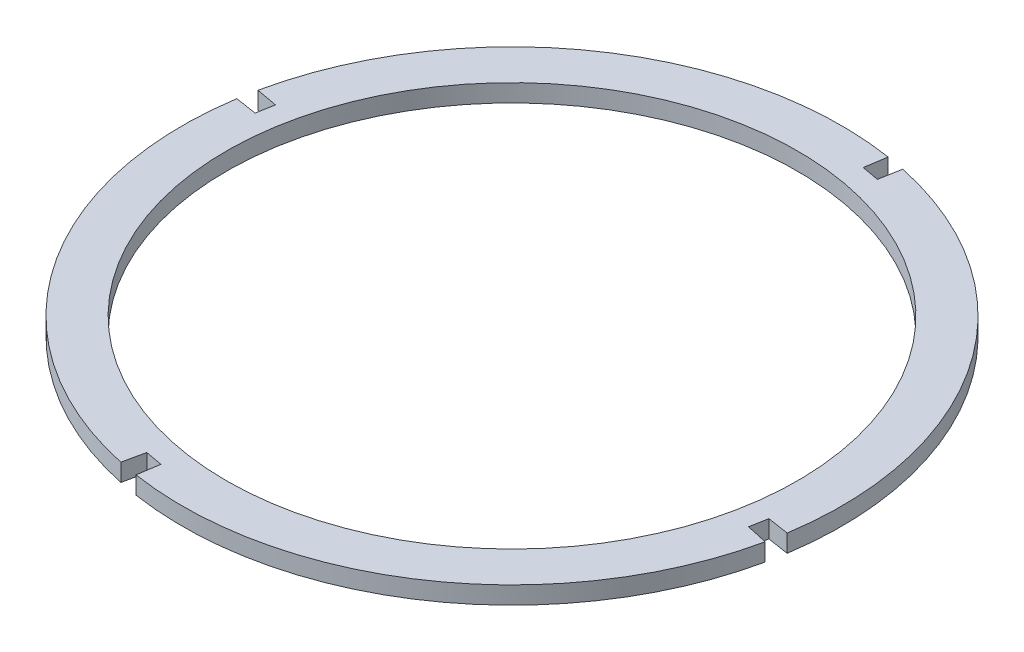
ISO-10303-21;
HEADER;
FILE_DESCRIPTION(('STEP AP214'),'2;1');
FILE_NAME('part.step','',(''),(''),'','','');
FILE_SCHEMA(('AUTOMOTIVE_DESIGN { 1 0 10303 214 1 1 1 1 }'));
ENDSEC;
DATA;
#1=APPLICATION_CONTEXT('core data for automotive mechanical design processes');
#2=APPLICATION_PROTOCOL_DEFINITION('international standard','automotive_design',2000,#1);
#3=PRODUCT_CONTEXT('',#1,'mechanical');
#4=PRODUCT('Part','Part','',(#3));
#5=PRODUCT_RELATED_PRODUCT_CATEGORY('part','',(#4));
#6=PRODUCT_DEFINITION_FORMATION('','',#4);
#7=PRODUCT_DEFINITION_CONTEXT('part definition',#1,'design');
#8=PRODUCT_DEFINITION('design','',#6,#7);
#9=PRODUCT_DEFINITION_SHAPE('','',#8);
#10=(LENGTH_UNIT() NAMED_UNIT(*) SI_UNIT(.MILLI.,.METRE.));
#11=(NAMED_UNIT(*) PLANE_ANGLE_UNIT() SI_UNIT($,.RADIAN.));
#12=(NAMED_UNIT(*) SI_UNIT($,.STERADIAN.) SOLID_ANGLE_UNIT());
#13=UNCERTAINTY_MEASURE_WITH_UNIT(LENGTH_MEASURE(1.E-05),#10,'distance_accuracy_value','');
#14=(GEOMETRIC_REPRESENTATION_CONTEXT(3) GLOBAL_UNCERTAINTY_ASSIGNED_CONTEXT((#13)) GLOBAL_UNIT_ASSIGNED_CONTEXT((#10,
#11,#12)) REPRESENTATION_CONTEXT('',''));
#15=CARTESIAN_POINT('',(0.,0.,0.));
#16=DIRECTION('',(0.,0.,1.));
#17=DIRECTION('',(1.,0.,0.));
#18=AXIS2_PLACEMENT_3D('',#15,#16,#17);
#19=CARTESIAN_POINT('',(-607.060293315241,16.,-210.593190869068));
#20=DIRECTION('',(0.,1.,0.));
#21=DIRECTION('',(0.,0.,1.));
#22=AXIS2_PLACEMENT_3D('',#19,#20,#21);
#23=PLANE('',#22);
#24=DIRECTION('',(0.153255971764711,0.,-0.988186524457025));
#25=VECTOR('',#24,1.);
#26=CARTESIAN_POINT('',(-564.131109825946,16.,-487.398330281151));
#27=LINE('',#26,#25);
#28=CARTESIAN_POINT('',(-564.131109825946,16.,-487.398330281151));
#29=VERTEX_POINT('',#28);
#30=CARTESIAN_POINT('',(-561.083501785828,16.,-507.049148206176));
#31=VERTEX_POINT('',#30);
#32=EDGE_CURVE('E217',#29,#31,#27,.T.);
#33=ORIENTED_EDGE('',*,*,#32,.T.);
#34=CARTESIAN_POINT('',(-607.060293315241,16.,-210.593190869068));
#35=DIRECTION('',(0.,1.,0.));
#36=DIRECTION('',(0.,0.,1.));
#37=AXIS2_PLACEMENT_3D('',#34,#35,#36);
#38=CIRCLE('',#37,300.);
#39=CARTESIAN_POINT('',(-900.525993415086,16.,-272.865840282012));
#40=VERTEX_POINT('',#39);
#41=EDGE_CURVE('E125',#31,#40,#38,.T.);
#42=ORIENTED_EDGE('',*,*,#41,.T.);
#43=DIRECTION('',(0.983406473892088,0.,0.181415840287255));
#44=VECTOR('',#43,1.);
#45=CARTESIAN_POINT('',(-880.962779282727,16.,-269.256877940637));
#46=LINE('',#45,#44);
#47=CARTESIAN_POINT('',(-880.962779282727,16.,-269.256877940637));
#48=VERTEX_POINT('',#47);
#49=EDGE_CURVE('E256',#40,#48,#46,.T.);
#50=ORIENTED_EDGE('',*,*,#49,.T.);
#51=DIRECTION('',(-0.181415840287255,0.,0.983406473892088));
#52=VECTOR('',#51,1.);
#53=CARTESIAN_POINT('',(-880.962779282727,16.,-269.256877940637));
#54=LINE('',#53,#52);
#55=CARTESIAN_POINT('',(-883.865432727323,16.,-253.522374358363));
#56=VERTEX_POINT('',#55);
#57=EDGE_CURVE('E275',#48,#56,#54,.T.);
#58=ORIENTED_EDGE('',*,*,#57,.T.);
#59=DIRECTION('',(-0.988186524457025,0.,-0.153255971764708));
#60=VECTOR('',#59,1.);
#61=CARTESIAN_POINT('',(-883.865432727323,16.,-253.522374358363));
#62=LINE('',#61,#60);
#63=CARTESIAN_POINT('',(-903.516250652348,16.,-256.569982398481));
#64=VERTEX_POINT('',#63);
#65=EDGE_CURVE('E272',#56,#64,#62,.T.);
#66=ORIENTED_EDGE('',*,*,#65,.T.);
#67=CARTESIAN_POINT('',(-607.060293315241,16.,-210.593190869068));
#68=DIRECTION('',(0.,1.,0.));
#69=DIRECTION('',(0.,0.,1.));
#70=AXIS2_PLACEMENT_3D('',#67,#68,#69);
#71=CIRCLE('',#70,300.);
#72=CARTESIAN_POINT('',(-669.71907856898,16.,82.7903066738674));
#73=VERTEX_POINT('',#72);
#74=EDGE_CURVE('E274',#64,#73,#71,.T.);
#75=ORIENTED_EDGE('',*,*,#74,.T.);
#76=DIRECTION('',(0.208862617512463,0.,-0.977944991809786));
#77=VECTOR('',#76,1.);
#78=CARTESIAN_POINT('',(-665.565211025494,16.,63.3409001253245));
#79=LINE('',#78,#77);
#80=CARTESIAN_POINT('',(-665.565211025494,16.,63.3409001253245));
#81=VERTEX_POINT('',#80);
#82=EDGE_CURVE('E277',#73,#81,#79,.T.);
#83=ORIENTED_EDGE('',*,*,#82,.T.);
#84=DIRECTION('',(0.983458871104075,0.,0.18113157882241));
#85=VECTOR('',#84,1.);
#86=CARTESIAN_POINT('',(-665.565211025494,16.,63.3409001253245));
#87=LINE('',#86,#85);
#88=CARTESIAN_POINT('',(-649.829869087829,16.,66.239005386483));
#89=VERTEX_POINT('',#88);
#90=EDGE_CURVE('E283',#81,#89,#87,.T.);
#91=ORIENTED_EDGE('',*,*,#90,.T.);
#92=DIRECTION('',(-0.152684910427231,0.,0.988274920317129));
#93=VECTOR('',#92,1.);
#94=CARTESIAN_POINT('',(-649.829869087829,16.,66.239005386483));
#95=LINE('',#94,#93);
#96=CARTESIAN_POINT('',(-652.86576644341,16.,85.8892852260704));
#97=VERTEX_POINT('',#96);
#98=EDGE_CURVE('E285',#89,#97,#95,.T.);
#99=ORIENTED_EDGE('',*,*,#98,.T.);
#100=CARTESIAN_POINT('',(-607.060293315241,16.,-210.593190869068));
#101=DIRECTION('',(0.,1.,0.));
#102=DIRECTION('',(0.,0.,1.));
#103=AXIS2_PLACEMENT_3D('',#100,#101,#102);
#104=CIRCLE('',#103,300.);
#105=CARTESIAN_POINT('',(-313.7130532063,16.,-147.764879412626));
#106=VERTEX_POINT('',#105);
#107=EDGE_CURVE('E287',#97,#106,#104,.T.);
#108=ORIENTED_EDGE('',*,*,#107,.T.);
#109=DIRECTION('',(-0.977824133696468,0.,-0.209427704854806));
#110=VECTOR('',#109,1.);
#111=CARTESIAN_POINT('',(-333.157807347754,16.,-151.9295037975));
#112=LINE('',#111,#110);
#113=CARTESIAN_POINT('',(-333.157807347754,16.,-151.9295037975));
#114=VERTEX_POINT('',#113);
#115=EDGE_CURVE('E289',#106,#114,#112,.T.);
#116=ORIENTED_EDGE('',*,*,#115,.T.);
#117=DIRECTION('',(0.181415840287254,0.,-0.983406473892088));
#118=VECTOR('',#117,1.);
#119=CARTESIAN_POINT('',(-330.255153903158,16.,-167.664007379774));
#120=LINE('',#119,#118);
#121=CARTESIAN_POINT('',(-330.255153903158,16.,-167.664007379774));
#122=VERTEX_POINT('',#121);
#123=EDGE_CURVE('E291',#114,#122,#120,.T.);
#124=ORIENTED_EDGE('',*,*,#123,.T.);
#125=DIRECTION('',(0.988186524457026,0.,0.153255971764704));
#126=VECTOR('',#125,1.);
#127=CARTESIAN_POINT('',(-330.255153903158,16.,-167.664007379774));
#128=LINE('',#127,#126);
#129=CARTESIAN_POINT('',(-310.604335978133,16.,-164.616399339656));
#130=VERTEX_POINT('',#129);
#131=EDGE_CURVE('E168',#122,#130,#128,.T.);
#132=ORIENTED_EDGE('',*,*,#131,.T.);
#133=CARTESIAN_POINT('',(-607.060293315241,16.,-210.593190869068));
#134=DIRECTION('',(0.,1.,0.));
#135=DIRECTION('',(0.,0.,1.));
#136=AXIS2_PLACEMENT_3D('',#133,#134,#135);
#137=CIRCLE('',#136,300.);
#138=CARTESIAN_POINT('',(-544.787643902297,16.,-504.058890968914));
#139=VERTEX_POINT('',#138);
#140=EDGE_CURVE('E162',#130,#139,#137,.T.);
#141=ORIENTED_EDGE('',*,*,#140,.T.);
#142=DIRECTION('',(-0.181415840287255,0.,0.983406473892088));
#143=VECTOR('',#142,1.);
#144=CARTESIAN_POINT('',(-548.396606243673,16.,-484.495676836555));
#145=LINE('',#144,#143);
#146=CARTESIAN_POINT('',(-548.396606243673,16.,-484.495676836555));
#147=VERTEX_POINT('',#146);
#148=EDGE_CURVE('E166',#139,#147,#145,.T.);
#149=ORIENTED_EDGE('',*,*,#148,.T.);
#150=DIRECTION('',(-0.983406473892088,0.,-0.181415840287254));
#151=VECTOR('',#150,1.);
#152=CARTESIAN_POINT('',(-564.131109825946,16.,-487.398330281151));
#153=LINE('',#152,#151);
#154=EDGE_CURVE('E58',#147,#29,#153,.T.);
#155=ORIENTED_EDGE('',*,*,#154,.T.);
#156=EDGE_LOOP('',(#33,#42,#50,#58,#66,#75,#83,#91,#99,#108,#116,#124,#132,#141,#149,#155));
#157=FACE_BOUND('',#156,.T.);
#158=CARTESIAN_POINT('',(-607.060293315241,16.,-210.593190869068));
#159=DIRECTION('',(0.,1.,0.));
#160=DIRECTION('',(0.,0.,1.));
#161=AXIS2_PLACEMENT_3D('',#158,#159,#160);
#162=CIRCLE('',#161,260.);
#163=CARTESIAN_POINT('',(-607.060293315241,16.,49.4068091309316));
#164=VERTEX_POINT('',#163);
#165=EDGE_CURVE('E190',#164,#164,#162,.T.);
#166=ORIENTED_EDGE('',*,*,#165,.F.);
#167=EDGE_LOOP('',(#166));
#168=FACE_BOUND('',#167,.T.);
#169=ADVANCED_FACE('F41',(#157,#168),#23,.T.);
#170=CARTESIAN_POINT('',(-607.060293315241,0.,-210.593190869068));
#171=DIRECTION('',(0.,1.,0.));
#172=DIRECTION('',(0.,0.,1.));
#173=AXIS2_PLACEMENT_3D('',#170,#171,#172);
#174=PLANE('',#173);
#175=DIRECTION('',(0.153255971764711,0.,-0.988186524457025));
#176=VECTOR('',#175,1.);
#177=CARTESIAN_POINT('',(-564.131109825946,0.,-487.398330281151));
#178=LINE('',#177,#176);
#179=CARTESIAN_POINT('',(-564.131109825946,0.,-487.398330281151));
#180=VERTEX_POINT('',#179);
#181=CARTESIAN_POINT('',(-561.083501785828,0.,-507.049148206176));
#182=VERTEX_POINT('',#181);
#183=EDGE_CURVE('E186',#180,#182,#178,.T.);
#184=ORIENTED_EDGE('',*,*,#183,.F.);
#185=DIRECTION('',(-0.983406473892088,0.,-0.181415840287254));
#186=VECTOR('',#185,1.);
#187=CARTESIAN_POINT('',(-564.131109825946,0.,-487.398330281151));
#188=LINE('',#187,#186);
#189=CARTESIAN_POINT('',(-548.396606243673,0.,-484.495676836555));
#190=VERTEX_POINT('',#189);
#191=EDGE_CURVE('E117',#190,#180,#188,.T.);
#192=ORIENTED_EDGE('',*,*,#191,.F.);
#193=DIRECTION('',(-0.181415840287255,0.,0.983406473892088));
#194=VECTOR('',#193,1.);
#195=CARTESIAN_POINT('',(-548.396606243673,0.,-484.495676836555));
#196=LINE('',#195,#194);
#197=CARTESIAN_POINT('',(-544.787643902297,0.,-504.058890968914));
#198=VERTEX_POINT('',#197);
#199=EDGE_CURVE('E111',#198,#190,#196,.T.);
#200=ORIENTED_EDGE('',*,*,#199,.F.);
#201=CARTESIAN_POINT('',(-607.060293315241,0.,-210.593190869068));
#202=DIRECTION('',(0.,1.,0.));
#203=DIRECTION('',(0.,0.,1.));
#204=AXIS2_PLACEMENT_3D('',#201,#202,#203);
#205=CIRCLE('',#204,300.);
#206=CARTESIAN_POINT('',(-310.604335978133,0.,-164.616399339656));
#207=VERTEX_POINT('',#206);
#208=EDGE_CURVE('E176',#207,#198,#205,.T.);
#209=ORIENTED_EDGE('',*,*,#208,.F.);
#210=DIRECTION('',(0.988186524457026,0.,0.153255971764704));
#211=VECTOR('',#210,1.);
#212=CARTESIAN_POINT('',(-330.255153903158,0.,-167.664007379774));
#213=LINE('',#212,#211);
#214=CARTESIAN_POINT('',(-330.255153903158,0.,-167.664007379774));
#215=VERTEX_POINT('',#214);
#216=EDGE_CURVE('E212',#215,#207,#213,.T.);
#217=ORIENTED_EDGE('',*,*,#216,.F.);
#218=DIRECTION('',(0.181415840287254,0.,-0.983406473892088));
#219=VECTOR('',#218,1.);
#220=CARTESIAN_POINT('',(-330.255153903158,0.,-167.664007379774));
#221=LINE('',#220,#219);
#222=CARTESIAN_POINT('',(-333.157807347754,0.,-151.9295037975));
#223=VERTEX_POINT('',#222);
#224=EDGE_CURVE('E210',#223,#215,#221,.T.);
#225=ORIENTED_EDGE('',*,*,#224,.F.);
#226=DIRECTION('',(-0.977824133696468,0.,-0.209427704854806));
#227=VECTOR('',#226,1.);
#228=CARTESIAN_POINT('',(-333.157807347754,0.,-151.9295037975));
#229=LINE('',#228,#227);
#230=CARTESIAN_POINT('',(-313.7130532063,0.,-147.764879412626));
#231=VERTEX_POINT('',#230);
#232=EDGE_CURVE('E208',#231,#223,#229,.T.);
#233=ORIENTED_EDGE('',*,*,#232,.F.);
#234=CARTESIAN_POINT('',(-607.060293315241,0.,-210.593190869068));
#235=DIRECTION('',(0.,1.,0.));
#236=DIRECTION('',(0.,0.,1.));
#237=AXIS2_PLACEMENT_3D('',#234,#235,#236);
#238=CIRCLE('',#237,300.);
#239=CARTESIAN_POINT('',(-652.86576644341,0.,85.8892852260704));
#240=VERTEX_POINT('',#239);
#241=EDGE_CURVE('E206',#240,#231,#238,.T.);
#242=ORIENTED_EDGE('',*,*,#241,.F.);
#243=DIRECTION('',(-0.152684910427231,0.,0.988274920317129));
#244=VECTOR('',#243,1.);
#245=CARTESIAN_POINT('',(-649.829869087829,0.,66.239005386483));
#246=LINE('',#245,#244);
#247=CARTESIAN_POINT('',(-649.829869087829,0.,66.239005386483));
#248=VERTEX_POINT('',#247);
#249=EDGE_CURVE('E204',#248,#240,#246,.T.);
#250=ORIENTED_EDGE('',*,*,#249,.F.);
#251=DIRECTION('',(0.983458871104075,0.,0.18113157882241));
#252=VECTOR('',#251,1.);
#253=CARTESIAN_POINT('',(-665.565211025494,0.,63.3409001253245));
#254=LINE('',#253,#252);
#255=CARTESIAN_POINT('',(-665.565211025494,0.,63.3409001253245));
#256=VERTEX_POINT('',#255);
#257=EDGE_CURVE('E202',#256,#248,#254,.T.);
#258=ORIENTED_EDGE('',*,*,#257,.F.);
#259=DIRECTION('',(0.208862617512463,0.,-0.977944991809786));
#260=VECTOR('',#259,1.);
#261=CARTESIAN_POINT('',(-665.565211025494,0.,63.3409001253245));
#262=LINE('',#261,#260);
#263=CARTESIAN_POINT('',(-669.71907856898,0.,82.7903066738674));
#264=VERTEX_POINT('',#263);
#265=EDGE_CURVE('E200',#264,#256,#262,.T.);
#266=ORIENTED_EDGE('',*,*,#265,.F.);
#267=CARTESIAN_POINT('',(-607.060293315241,0.,-210.593190869068));
#268=DIRECTION('',(0.,1.,0.));
#269=DIRECTION('',(0.,0.,1.));
#270=AXIS2_PLACEMENT_3D('',#267,#268,#269);
#271=CIRCLE('',#270,300.);
#272=CARTESIAN_POINT('',(-903.516250652348,0.,-256.569982398481));
#273=VERTEX_POINT('',#272);
#274=EDGE_CURVE('E198',#273,#264,#271,.T.);
#275=ORIENTED_EDGE('',*,*,#274,.F.);
#276=DIRECTION('',(-0.988186524457025,0.,-0.153255971764708));
#277=VECTOR('',#276,1.);
#278=CARTESIAN_POINT('',(-883.865432727323,0.,-253.522374358363));
#279=LINE('',#278,#277);
#280=CARTESIAN_POINT('',(-883.865432727323,0.,-253.522374358363));
#281=VERTEX_POINT('',#280);
#282=EDGE_CURVE('E196',#281,#273,#279,.T.);
#283=ORIENTED_EDGE('',*,*,#282,.F.);
#284=DIRECTION('',(-0.181415840287255,0.,0.983406473892088));
#285=VECTOR('',#284,1.);
#286=CARTESIAN_POINT('',(-880.962779282727,0.,-269.256877940637));
#287=LINE('',#286,#285);
#288=CARTESIAN_POINT('',(-880.962779282727,0.,-269.256877940637));
#289=VERTEX_POINT('',#288);
#290=EDGE_CURVE('E194',#289,#281,#287,.T.);
#291=ORIENTED_EDGE('',*,*,#290,.F.);
#292=DIRECTION('',(0.983406473892088,0.,0.181415840287255));
#293=VECTOR('',#292,1.);
#294=CARTESIAN_POINT('',(-880.962779282727,0.,-269.256877940637));
#295=LINE('',#294,#293);
#296=CARTESIAN_POINT('',(-900.525993415086,0.,-272.865840282012));
#297=VERTEX_POINT('',#296);
#298=EDGE_CURVE('E192',#297,#289,#295,.T.);
#299=ORIENTED_EDGE('',*,*,#298,.F.);
#300=CARTESIAN_POINT('',(-607.060293315241,0.,-210.593190869068));
#301=DIRECTION('',(0.,1.,0.));
#302=DIRECTION('',(0.,0.,1.));
#303=AXIS2_PLACEMENT_3D('',#300,#301,#302);
#304=CIRCLE('',#303,300.);
#305=EDGE_CURVE('E189',#182,#297,#304,.T.);
#306=ORIENTED_EDGE('',*,*,#305,.F.);
#307=EDGE_LOOP('',(#184,#192,#200,#209,#217,#225,#233,#242,#250,#258,#266,#275,#283,#291,#299,#306));
#308=FACE_BOUND('',#307,.T.);
#309=CARTESIAN_POINT('',(-607.060293315241,0.,-210.593190869068));
#310=DIRECTION('',(0.,1.,0.));
#311=DIRECTION('',(0.,0.,1.));
#312=AXIS2_PLACEMENT_3D('',#309,#310,#311);
#313=CIRCLE('',#312,260.);
#314=CARTESIAN_POINT('',(-607.060293315241,0.,49.4068091309316));
#315=VERTEX_POINT('',#314);
#316=EDGE_CURVE('E490',#315,#315,#313,.T.);
#317=ORIENTED_EDGE('',*,*,#316,.T.);
#318=EDGE_LOOP('',(#317));
#319=FACE_BOUND('',#318,.T.);
#320=ADVANCED_FACE('F260',(#308,#319),#174,.F.);
#321=CARTESIAN_POINT('',(-564.131109825946,16.,-487.398330281151));
#322=DIRECTION('',(-0.988186524457025,0.,-0.153255971764711));
#323=DIRECTION('',(-0.153255971764711,0.,0.988186524457025));
#324=AXIS2_PLACEMENT_3D('',#321,#322,#323);
#325=PLANE('',#324);
#326=ORIENTED_EDGE('',*,*,#183,.T.);
#327=DIRECTION('',(0.,-1.,0.));
#328=VECTOR('',#327,1.);
#329=CARTESIAN_POINT('',(-561.083501785828,16.,-507.049148206176));
#330=LINE('',#329,#328);
#331=EDGE_CURVE('E11',#31,#182,#330,.T.);
#332=ORIENTED_EDGE('',*,*,#331,.F.);
#333=ORIENTED_EDGE('',*,*,#32,.F.);
#334=DIRECTION('',(0.,-1.,0.));
#335=VECTOR('',#334,1.);
#336=CARTESIAN_POINT('',(-564.131109825946,16.,-487.398330281151));
#337=LINE('',#336,#335);
#338=EDGE_CURVE('E182',#29,#180,#337,.T.);
#339=ORIENTED_EDGE('',*,*,#338,.T.);
#340=EDGE_LOOP('',(#326,#332,#333,#339));
#341=FACE_BOUND('',#340,.T.);
#342=ADVANCED_FACE('F43',(#341),#325,.F.);
#343=CARTESIAN_POINT('',(-607.060293315241,16.,-210.593190869068));
#344=DIRECTION('',(0.,-1.,0.));
#345=DIRECTION('',(0.,0.,-1.));
#346=AXIS2_PLACEMENT_3D('',#343,#344,#345);
#347=CYLINDRICAL_SURFACE('',#346,300.);
#348=ORIENTED_EDGE('',*,*,#305,.T.);
#349=DIRECTION('',(0.,-1.,0.));
#350=VECTOR('',#349,1.);
#351=CARTESIAN_POINT('',(-900.525993415086,16.,-272.865840282012));
#352=LINE('',#351,#350);
#353=EDGE_CURVE('E50',#40,#297,#352,.T.);
#354=ORIENTED_EDGE('',*,*,#353,.F.);
#355=ORIENTED_EDGE('',*,*,#41,.F.);
#356=ORIENTED_EDGE('',*,*,#331,.T.);
#357=EDGE_LOOP('',(#348,#354,#355,#356));
#358=FACE_BOUND('',#357,.T.);
#359=ADVANCED_FACE('F325',(#358),#347,.T.);
#360=CARTESIAN_POINT('',(-880.962779282727,16.,-269.256877940637));
#361=DIRECTION('',(0.181415840287255,0.,-0.983406473892088));
#362=DIRECTION('',(-0.983406473892088,0.,-0.181415840287255));
#363=AXIS2_PLACEMENT_3D('',#360,#361,#362);
#364=PLANE('',#363);
#365=ORIENTED_EDGE('',*,*,#298,.T.);
#366=DIRECTION('',(0.,-1.,0.));
#367=VECTOR('',#366,1.);
#368=CARTESIAN_POINT('',(-880.962779282727,16.,-269.256877940637));
#369=LINE('',#368,#367);
#370=EDGE_CURVE('E248',#48,#289,#369,.T.);
#371=ORIENTED_EDGE('',*,*,#370,.F.);
#372=ORIENTED_EDGE('',*,*,#49,.F.);
#373=ORIENTED_EDGE('',*,*,#353,.T.);
#374=EDGE_LOOP('',(#365,#371,#372,#373));
#375=FACE_BOUND('',#374,.T.);
#376=ADVANCED_FACE('F254',(#375),#364,.F.);
#377=CARTESIAN_POINT('',(-880.962779282727,16.,-269.256877940637));
#378=DIRECTION('',(0.983406473892088,0.,0.181415840287255));
#379=DIRECTION('',(0.181415840287255,0.,-0.983406473892088));
#380=AXIS2_PLACEMENT_3D('',#377,#378,#379);
#381=PLANE('',#380);
#382=ORIENTED_EDGE('',*,*,#290,.T.);
#383=DIRECTION('',(0.,-1.,0.));
#384=VECTOR('',#383,1.);
#385=CARTESIAN_POINT('',(-883.865432727323,16.,-253.522374358363));
#386=LINE('',#385,#384);
#387=EDGE_CURVE('E245',#56,#281,#386,.T.);
#388=ORIENTED_EDGE('',*,*,#387,.F.);
#389=ORIENTED_EDGE('',*,*,#57,.F.);
#390=ORIENTED_EDGE('',*,*,#370,.T.);
#391=EDGE_LOOP('',(#382,#388,#389,#390));
#392=FACE_BOUND('',#391,.T.);
#393=ADVANCED_FACE('F266',(#392),#381,.F.);
#394=CARTESIAN_POINT('',(-883.865432727323,16.,-253.522374358363));
#395=DIRECTION('',(-0.153255971764708,0.,0.988186524457025));
#396=DIRECTION('',(0.988186524457025,0.,0.153255971764708));
#397=AXIS2_PLACEMENT_3D('',#394,#395,#396);
#398=PLANE('',#397);
#399=ORIENTED_EDGE('',*,*,#282,.T.);
#400=DIRECTION('',(0.,-1.,0.));
#401=VECTOR('',#400,1.);
#402=CARTESIAN_POINT('',(-903.516250652348,16.,-256.569982398481));
#403=LINE('',#402,#401);
#404=EDGE_CURVE('E242',#64,#273,#403,.T.);
#405=ORIENTED_EDGE('',*,*,#404,.F.);
#406=ORIENTED_EDGE('',*,*,#65,.F.);
#407=ORIENTED_EDGE('',*,*,#387,.T.);
#408=EDGE_LOOP('',(#399,#405,#406,#407));
#409=FACE_BOUND('',#408,.T.);
#410=ADVANCED_FACE('F270',(#409),#398,.F.);
#411=CARTESIAN_POINT('',(-607.060293315241,16.,-210.593190869068));
#412=DIRECTION('',(0.,-1.,0.));
#413=DIRECTION('',(0.,0.,-1.));
#414=AXIS2_PLACEMENT_3D('',#411,#412,#413);
#415=CYLINDRICAL_SURFACE('',#414,300.);
#416=ORIENTED_EDGE('',*,*,#274,.T.);
#417=DIRECTION('',(0.,-1.,0.));
#418=VECTOR('',#417,1.);
#419=CARTESIAN_POINT('',(-669.71907856898,16.,82.7903066738674));
#420=LINE('',#419,#418);
#421=EDGE_CURVE('E239',#73,#264,#420,.T.);
#422=ORIENTED_EDGE('',*,*,#421,.F.);
#423=ORIENTED_EDGE('',*,*,#74,.F.);
#424=ORIENTED_EDGE('',*,*,#404,.T.);
#425=EDGE_LOOP('',(#416,#422,#423,#424));
#426=FACE_BOUND('',#425,.T.);
#427=ADVANCED_FACE('F338',(#426),#415,.T.);
#428=CARTESIAN_POINT('',(-665.565211025494,16.,63.3409001253245));
#429=DIRECTION('',(-0.977944991809786,0.,-0.208862617512463));
#430=DIRECTION('',(-0.208862617512463,0.,0.977944991809786));
#431=AXIS2_PLACEMENT_3D('',#428,#429,#430);
#432=PLANE('',#431);
#433=ORIENTED_EDGE('',*,*,#265,.T.);
#434=DIRECTION('',(0.,-1.,0.));
#435=VECTOR('',#434,1.);
#436=CARTESIAN_POINT('',(-665.565211025494,16.,63.3409001253245));
#437=LINE('',#436,#435);
#438=EDGE_CURVE('E236',#81,#256,#437,.T.);
#439=ORIENTED_EDGE('',*,*,#438,.F.);
#440=ORIENTED_EDGE('',*,*,#82,.F.);
#441=ORIENTED_EDGE('',*,*,#421,.T.);
#442=EDGE_LOOP('',(#433,#439,#440,#441));
#443=FACE_BOUND('',#442,.T.);
#444=ADVANCED_FACE('F341',(#443),#432,.F.);
#445=CARTESIAN_POINT('',(-665.565211025494,16.,63.3409001253245));
#446=DIRECTION('',(0.18113157882241,0.,-0.983458871104075));
#447=DIRECTION('',(-0.983458871104075,0.,-0.18113157882241));
#448=AXIS2_PLACEMENT_3D('',#445,#446,#447);
#449=PLANE('',#448);
#450=ORIENTED_EDGE('',*,*,#257,.T.);
#451=DIRECTION('',(0.,-1.,0.));
#452=VECTOR('',#451,1.);
#453=CARTESIAN_POINT('',(-649.829869087829,16.,66.239005386483));
#454=LINE('',#453,#452);
#455=EDGE_CURVE('E233',#89,#248,#454,.T.);
#456=ORIENTED_EDGE('',*,*,#455,.F.);
#457=ORIENTED_EDGE('',*,*,#90,.F.);
#458=ORIENTED_EDGE('',*,*,#438,.T.);
#459=EDGE_LOOP('',(#450,#456,#457,#458));
#460=FACE_BOUND('',#459,.T.);
#461=ADVANCED_FACE('F345',(#460),#449,.F.);
#462=CARTESIAN_POINT('',(-649.829869087829,16.,66.239005386483));
#463=DIRECTION('',(0.988274920317129,0.,0.152684910427231));
#464=DIRECTION('',(0.152684910427231,0.,-0.988274920317129));
#465=AXIS2_PLACEMENT_3D('',#462,#463,#464);
#466=PLANE('',#465);
#467=ORIENTED_EDGE('',*,*,#249,.T.);
#468=DIRECTION('',(0.,-1.,0.));
#469=VECTOR('',#468,1.);
#470=CARTESIAN_POINT('',(-652.86576644341,16.,85.8892852260704));
#471=LINE('',#470,#469);
#472=EDGE_CURVE('E230',#97,#240,#471,.T.);
#473=ORIENTED_EDGE('',*,*,#472,.F.);
#474=ORIENTED_EDGE('',*,*,#98,.F.);
#475=ORIENTED_EDGE('',*,*,#455,.T.);
#476=EDGE_LOOP('',(#467,#473,#474,#475));
#477=FACE_BOUND('',#476,.T.);
#478=ADVANCED_FACE('F349',(#477),#466,.F.);
#479=CARTESIAN_POINT('',(-607.060293315241,16.,-210.593190869068));
#480=DIRECTION('',(0.,-1.,0.));
#481=DIRECTION('',(0.,0.,-1.));
#482=AXIS2_PLACEMENT_3D('',#479,#480,#481);
#483=CYLINDRICAL_SURFACE('',#482,300.);
#484=ORIENTED_EDGE('',*,*,#241,.T.);
#485=DIRECTION('',(0.,-1.,0.));
#486=VECTOR('',#485,1.);
#487=CARTESIAN_POINT('',(-313.7130532063,16.,-147.764879412626));
#488=LINE('',#487,#486);
#489=EDGE_CURVE('E227',#106,#231,#488,.T.);
#490=ORIENTED_EDGE('',*,*,#489,.F.);
#491=ORIENTED_EDGE('',*,*,#107,.F.);
#492=ORIENTED_EDGE('',*,*,#472,.T.);
#493=EDGE_LOOP('',(#484,#490,#491,#492));
#494=FACE_BOUND('',#493,.T.);
#495=ADVANCED_FACE('F353',(#494),#483,.T.);
#496=CARTESIAN_POINT('',(-333.157807347754,16.,-151.9295037975));
#497=DIRECTION('',(-0.209427704854806,0.,0.977824133696468));
#498=DIRECTION('',(0.977824133696468,0.,0.209427704854806));
#499=AXIS2_PLACEMENT_3D('',#496,#497,#498);
#500=PLANE('',#499);
#501=ORIENTED_EDGE('',*,*,#232,.T.);
#502=DIRECTION('',(0.,-1.,0.));
#503=VECTOR('',#502,1.);
#504=CARTESIAN_POINT('',(-333.157807347754,16.,-151.9295037975));
#505=LINE('',#504,#503);
#506=EDGE_CURVE('E224',#114,#223,#505,.T.);
#507=ORIENTED_EDGE('',*,*,#506,.F.);
#508=ORIENTED_EDGE('',*,*,#115,.F.);
#509=ORIENTED_EDGE('',*,*,#489,.T.);
#510=EDGE_LOOP('',(#501,#507,#508,#509));
#511=FACE_BOUND('',#510,.T.);
#512=ADVANCED_FACE('F357',(#511),#500,.F.);
#513=CARTESIAN_POINT('',(-330.255153903158,16.,-167.664007379774));
#514=DIRECTION('',(-0.983406473892088,0.,-0.181415840287254));
#515=DIRECTION('',(-0.181415840287254,0.,0.983406473892088));
#516=AXIS2_PLACEMENT_3D('',#513,#514,#515);
#517=PLANE('',#516);
#518=ORIENTED_EDGE('',*,*,#224,.T.);
#519=DIRECTION('',(0.,-1.,0.));
#520=VECTOR('',#519,1.);
#521=CARTESIAN_POINT('',(-330.255153903158,16.,-167.664007379774));
#522=LINE('',#521,#520);
#523=EDGE_CURVE('E221',#122,#215,#522,.T.);
#524=ORIENTED_EDGE('',*,*,#523,.F.);
#525=ORIENTED_EDGE('',*,*,#123,.F.);
#526=ORIENTED_EDGE('',*,*,#506,.T.);
#527=EDGE_LOOP('',(#518,#524,#525,#526));
#528=FACE_BOUND('',#527,.T.);
#529=ADVANCED_FACE('F297',(#528),#517,.F.);
#530=CARTESIAN_POINT('',(-330.255153903158,16.,-167.664007379774));
#531=DIRECTION('',(0.153255971764704,0.,-0.988186524457026));
#532=DIRECTION('',(-0.988186524457026,0.,-0.153255971764704));
#533=AXIS2_PLACEMENT_3D('',#530,#531,#532);
#534=PLANE('',#533);
#535=ORIENTED_EDGE('',*,*,#216,.T.);
#536=DIRECTION('',(0.,-1.,0.));
#537=VECTOR('',#536,1.);
#538=CARTESIAN_POINT('',(-310.604335978133,16.,-164.616399339656));
#539=LINE('',#538,#537);
#540=EDGE_CURVE('E177',#130,#207,#539,.T.);
#541=ORIENTED_EDGE('',*,*,#540,.F.);
#542=ORIENTED_EDGE('',*,*,#131,.F.);
#543=ORIENTED_EDGE('',*,*,#523,.T.);
#544=EDGE_LOOP('',(#535,#541,#542,#543));
#545=FACE_BOUND('',#544,.T.);
#546=ADVANCED_FACE('F301',(#545),#534,.F.);
#547=CARTESIAN_POINT('',(-607.060293315241,16.,-210.593190869068));
#548=DIRECTION('',(0.,-1.,0.));
#549=DIRECTION('',(0.,0.,-1.));
#550=AXIS2_PLACEMENT_3D('',#547,#548,#549);
#551=CYLINDRICAL_SURFACE('',#550,300.);
#552=ORIENTED_EDGE('',*,*,#208,.T.);
#553=DIRECTION('',(0.,-1.,0.));
#554=VECTOR('',#553,1.);
#555=CARTESIAN_POINT('',(-544.787643902297,16.,-504.058890968914));
#556=LINE('',#555,#554);
#557=EDGE_CURVE('E173',#139,#198,#556,.T.);
#558=ORIENTED_EDGE('',*,*,#557,.F.);
#559=ORIENTED_EDGE('',*,*,#140,.F.);
#560=ORIENTED_EDGE('',*,*,#540,.T.);
#561=EDGE_LOOP('',(#552,#558,#559,#560));
#562=FACE_BOUND('',#561,.T.);
#563=ADVANCED_FACE('F174',(#562),#551,.T.);
#564=CARTESIAN_POINT('',(-548.396606243673,16.,-484.495676836555));
#565=DIRECTION('',(0.983406473892088,0.,0.181415840287255));
#566=DIRECTION('',(0.181415840287255,0.,-0.983406473892088));
#567=AXIS2_PLACEMENT_3D('',#564,#565,#566);
#568=PLANE('',#567);
#569=ORIENTED_EDGE('',*,*,#199,.T.);
#570=DIRECTION('',(0.,-1.,0.));
#571=VECTOR('',#570,1.);
#572=CARTESIAN_POINT('',(-548.396606243673,16.,-484.495676836555));
#573=LINE('',#572,#571);
#574=EDGE_CURVE('E178',#147,#190,#573,.T.);
#575=ORIENTED_EDGE('',*,*,#574,.F.);
#576=ORIENTED_EDGE('',*,*,#148,.F.);
#577=ORIENTED_EDGE('',*,*,#557,.T.);
#578=EDGE_LOOP('',(#569,#575,#576,#577));
#579=FACE_BOUND('',#578,.T.);
#580=ADVANCED_FACE('F180',(#579),#568,.F.);
#581=CARTESIAN_POINT('',(-564.131109825946,16.,-487.398330281151));
#582=DIRECTION('',(-0.181415840287254,0.,0.983406473892088));
#583=DIRECTION('',(0.983406473892088,0.,0.181415840287254));
#584=AXIS2_PLACEMENT_3D('',#581,#582,#583);
#585=PLANE('',#584);
#586=ORIENTED_EDGE('',*,*,#191,.T.);
#587=ORIENTED_EDGE('',*,*,#338,.F.);
#588=ORIENTED_EDGE('',*,*,#154,.F.);
#589=ORIENTED_EDGE('',*,*,#574,.T.);
#590=EDGE_LOOP('',(#586,#587,#588,#589));
#591=FACE_BOUND('',#590,.T.);
#592=ADVANCED_FACE('F305',(#591),#585,.F.);
#593=CARTESIAN_POINT('',(-607.060293315241,16.,-210.593190869068));
#594=DIRECTION('',(0.,-1.,0.));
#595=DIRECTION('',(0.,0.,-1.));
#596=AXIS2_PLACEMENT_3D('',#593,#594,#595);
#597=CYLINDRICAL_SURFACE('',#596,260.);
#598=ORIENTED_EDGE('',*,*,#165,.T.);
#599=EDGE_LOOP('',(#598));
#600=FACE_BOUND('',#599,.T.);
#601=ORIENTED_EDGE('',*,*,#316,.F.);
#602=EDGE_LOOP('',(#601));
#603=FACE_BOUND('',#602,.T.);
#604=ADVANCED_FACE('F307',(#600,#603),#597,.F.);
#605=CLOSED_SHELL('',(#169,#320,#342,#359,#376,#393,#410,#427,#444,#461,#478,#495,#512,#529,
#546,#563,#580,#592,#604));
#606=MANIFOLD_SOLID_BREP('B2',#605);
#607=ADVANCED_BREP_SHAPE_REPRESENTATION('',(#18,#606),#14);
#608=SHAPE_DEFINITION_REPRESENTATION(#9,#607);
ENDSEC;
END-ISO-10303-21;
